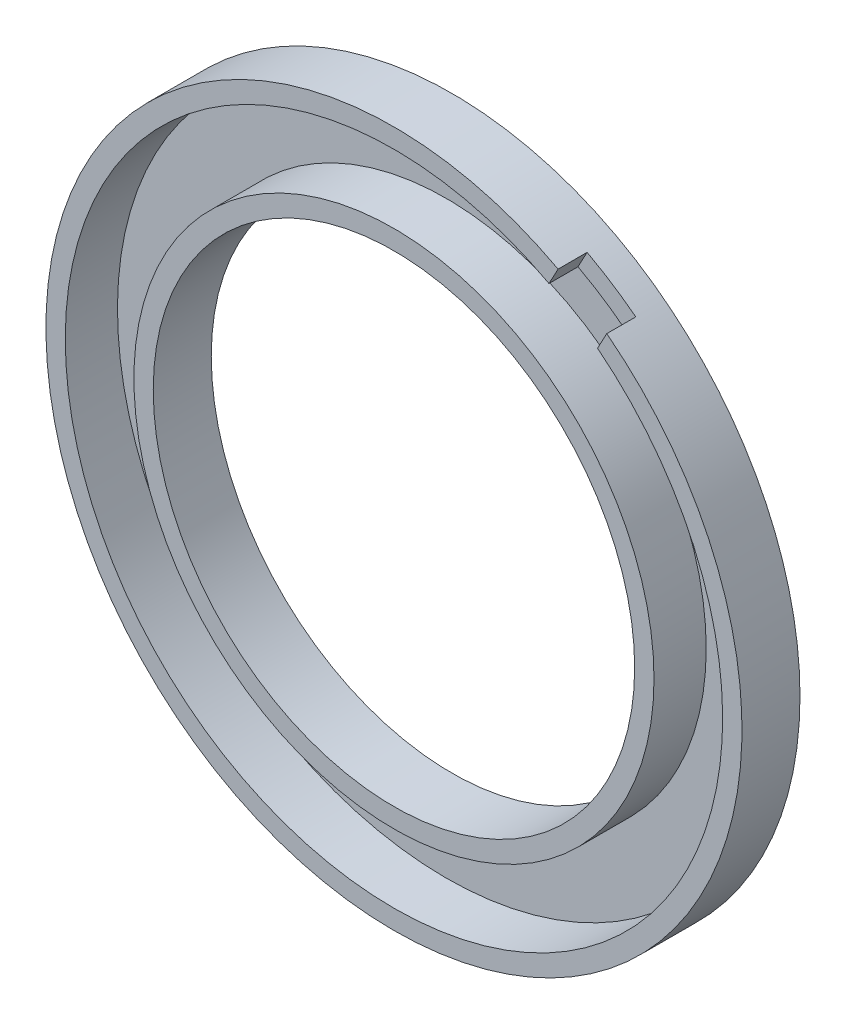
ISO-10303-21;
HEADER;
FILE_DESCRIPTION(('STEP AP214'),'2;1');
FILE_NAME('part.step','',(''),(''),'','','');
FILE_SCHEMA(('AUTOMOTIVE_DESIGN { 1 0 10303 214 1 1 1 1 }'));
ENDSEC;
DATA;
#1=APPLICATION_CONTEXT('core data for automotive mechanical design processes');
#2=APPLICATION_PROTOCOL_DEFINITION('international standard','automotive_design',2000,#1);
#3=PRODUCT_CONTEXT('',#1,'mechanical');
#4=PRODUCT('Part','Part','',(#3));
#5=PRODUCT_RELATED_PRODUCT_CATEGORY('part','',(#4));
#6=PRODUCT_DEFINITION_FORMATION('','',#4);
#7=PRODUCT_DEFINITION_CONTEXT('part definition',#1,'design');
#8=PRODUCT_DEFINITION('design','',#6,#7);
#9=PRODUCT_DEFINITION_SHAPE('','',#8);
#10=(LENGTH_UNIT() NAMED_UNIT(*) SI_UNIT(.MILLI.,.METRE.));
#11=(NAMED_UNIT(*) PLANE_ANGLE_UNIT() SI_UNIT($,.RADIAN.));
#12=(NAMED_UNIT(*) SI_UNIT($,.STERADIAN.) SOLID_ANGLE_UNIT());
#13=UNCERTAINTY_MEASURE_WITH_UNIT(LENGTH_MEASURE(1.E-05),#10,'distance_accuracy_value','');
#14=(GEOMETRIC_REPRESENTATION_CONTEXT(3) GLOBAL_UNCERTAINTY_ASSIGNED_CONTEXT((#13)) GLOBAL_UNIT_ASSIGNED_CONTEXT((#10,
#11,#12)) REPRESENTATION_CONTEXT('',''));
#15=CARTESIAN_POINT('',(0.,0.,0.));
#16=DIRECTION('',(0.,0.,1.));
#17=DIRECTION('',(1.,0.,0.));
#18=AXIS2_PLACEMENT_3D('',#15,#16,#17);
#19=CARTESIAN_POINT('',(0.,0.,6.));
#20=DIRECTION('',(0.,0.,-1.));
#21=DIRECTION('',(-1.,0.,0.));
#22=AXIS2_PLACEMENT_3D('',#19,#20,#21);
#23=CYLINDRICAL_SURFACE('',#22,34.);
#24=DIRECTION('',(0.,0.,1.));
#25=VECTOR('',#24,1.);
#26=CARTESIAN_POINT('',(21.0557681829435,26.695591887541,3.));
#27=LINE('',#26,#25);
#28=CARTESIAN_POINT('',(21.0557681829435,26.695591887541,3.));
#29=VERTEX_POINT('',#28);
#30=CARTESIAN_POINT('',(21.0557681829435,26.695591887541,6.));
#31=VERTEX_POINT('',#30);
#32=EDGE_CURVE('E92',#29,#31,#27,.T.);
#33=ORIENTED_EDGE('',*,*,#32,.F.);
#34=CARTESIAN_POINT('',(0.,0.,3.));
#35=DIRECTION('',(0.,0.,1.));
#36=DIRECTION('',(1.,0.,0.));
#37=AXIS2_PLACEMENT_3D('',#34,#35,#36);
#38=CIRCLE('',#37,34.);
#39=CARTESIAN_POINT('',(16.0352978469225,29.9811477925793,3.));
#40=VERTEX_POINT('',#39);
#41=EDGE_CURVE('E95',#29,#40,#38,.T.);
#42=ORIENTED_EDGE('',*,*,#41,.T.);
#43=DIRECTION('',(0.,0.,1.));
#44=VECTOR('',#43,1.);
#45=CARTESIAN_POINT('',(16.0352978469225,29.9811477925793,3.));
#46=LINE('',#45,#44);
#47=CARTESIAN_POINT('',(16.0352978469225,29.9811477925793,6.));
#48=VERTEX_POINT('',#47);
#49=EDGE_CURVE('E84',#40,#48,#46,.T.);
#50=ORIENTED_EDGE('',*,*,#49,.T.);
#51=CARTESIAN_POINT('',(0.,0.,6.));
#52=DIRECTION('',(0.,0.,1.));
#53=DIRECTION('',(1.,0.,0.));
#54=AXIS2_PLACEMENT_3D('',#51,#52,#53);
#55=CIRCLE('',#54,34.);
#56=EDGE_CURVE('E117',#48,#31,#55,.T.);
#57=ORIENTED_EDGE('',*,*,#56,.T.);
#58=EDGE_LOOP('',(#33,#42,#50,#57));
#59=FACE_BOUND('',#58,.T.);
#60=CARTESIAN_POINT('',(0.,0.,0.6));
#61=DIRECTION('',(0.,0.,1.));
#62=DIRECTION('',(1.,0.,0.));
#63=AXIS2_PLACEMENT_3D('',#60,#61,#62);
#64=CIRCLE('',#63,34.);
#65=CARTESIAN_POINT('',(34.,0.,0.6));
#66=VERTEX_POINT('',#65);
#67=EDGE_CURVE('E47',#66,#66,#64,.T.);
#68=ORIENTED_EDGE('',*,*,#67,.F.);
#69=EDGE_LOOP('',(#68));
#70=FACE_BOUND('',#69,.T.);
#71=ADVANCED_FACE('F40',(#59,#70),#23,.F.);
#72=CARTESIAN_POINT('',(0.,0.,6.));
#73=DIRECTION('',(0.,0.,-1.));
#74=DIRECTION('',(-1.,0.,0.));
#75=AXIS2_PLACEMENT_3D('',#72,#73,#74);
#76=CYLINDRICAL_SURFACE('',#75,36.);
#77=CARTESIAN_POINT('',(0.,0.,3.));
#78=DIRECTION('',(0.,0.,1.));
#79=DIRECTION('',(1.,0.,0.));
#80=AXIS2_PLACEMENT_3D('',#77,#78,#79);
#81=CIRCLE('',#80,36.);
#82=CARTESIAN_POINT('',(22.0151254384209,28.4839297136227,3.));
#83=VERTEX_POINT('',#82);
#84=CARTESIAN_POINT('',(16.9785506614473,31.7447447215546,3.));
#85=VERTEX_POINT('',#84);
#86=EDGE_CURVE('E12',#83,#85,#81,.T.);
#87=ORIENTED_EDGE('',*,*,#86,.F.);
#88=DIRECTION('',(0.,0.,1.));
#89=VECTOR('',#88,1.);
#90=CARTESIAN_POINT('',(22.0151254384209,28.4839297136227,3.));
#91=LINE('',#90,#89);
#92=CARTESIAN_POINT('',(22.0151254384209,28.4839297136227,6.));
#93=VERTEX_POINT('',#92);
#94=EDGE_CURVE('E63',#83,#93,#91,.T.);
#95=ORIENTED_EDGE('',*,*,#94,.T.);
#96=CARTESIAN_POINT('',(0.,0.,6.));
#97=DIRECTION('',(0.,0.,1.));
#98=DIRECTION('',(1.,0.,0.));
#99=AXIS2_PLACEMENT_3D('',#96,#97,#98);
#100=CIRCLE('',#99,36.);
#101=CARTESIAN_POINT('',(16.9785506614473,31.7447447215546,6.));
#102=VERTEX_POINT('',#101);
#103=EDGE_CURVE('E119',#102,#93,#100,.T.);
#104=ORIENTED_EDGE('',*,*,#103,.F.);
#105=DIRECTION('',(0.,0.,1.));
#106=VECTOR('',#105,1.);
#107=CARTESIAN_POINT('',(16.9785506614473,31.7447447215546,3.));
#108=LINE('',#107,#106);
#109=EDGE_CURVE('E54',#85,#102,#108,.T.);
#110=ORIENTED_EDGE('',*,*,#109,.F.);
#111=EDGE_LOOP('',(#87,#95,#104,#110));
#112=FACE_BOUND('',#111,.T.);
#113=CARTESIAN_POINT('',(0.,0.,0.));
#114=DIRECTION('',(0.,0.,1.));
#115=DIRECTION('',(1.,0.,0.));
#116=AXIS2_PLACEMENT_3D('',#113,#114,#115);
#117=CIRCLE('',#116,36.);
#118=CARTESIAN_POINT('',(36.,0.,0.));
#119=VERTEX_POINT('',#118);
#120=EDGE_CURVE('E116',#119,#119,#117,.T.);
#121=ORIENTED_EDGE('',*,*,#120,.T.);
#122=EDGE_LOOP('',(#121));
#123=FACE_BOUND('',#122,.T.);
#124=ADVANCED_FACE('F128',(#112,#123),#76,.T.);
#125=CARTESIAN_POINT('',(0.,0.,6.));
#126=DIRECTION('',(0.,0.,1.));
#127=DIRECTION('',(1.,0.,0.));
#128=AXIS2_PLACEMENT_3D('',#125,#126,#127);
#129=PLANE('',#128);
#130=DIRECTION('',(0.472726395517798,0.881209257203277,0.));
#131=VECTOR('',#130,1.);
#132=CARTESIAN_POINT('',(22.0151254384209,28.4839297136227,6.));
#133=LINE('',#132,#131);
#134=EDGE_CURVE('E77',#31,#93,#133,.T.);
#135=ORIENTED_EDGE('',*,*,#134,.F.);
#136=ORIENTED_EDGE('',*,*,#56,.F.);
#137=DIRECTION('',(-0.471626407262426,-0.881798464487627,0.));
#138=VECTOR('',#137,1.);
#139=CARTESIAN_POINT('',(16.0352978469225,29.9811477925793,6.));
#140=LINE('',#139,#138);
#141=EDGE_CURVE('E87',#102,#48,#140,.T.);
#142=ORIENTED_EDGE('',*,*,#141,.F.);
#143=ORIENTED_EDGE('',*,*,#103,.T.);
#144=EDGE_LOOP('',(#135,#136,#142,#143));
#145=FACE_BOUND('',#144,.T.);
#146=ADVANCED_FACE('F132',(#145),#129,.T.);
#147=CARTESIAN_POINT('',(0.,0.,0.));
#148=DIRECTION('',(0.,0.,1.));
#149=DIRECTION('',(1.,0.,0.));
#150=AXIS2_PLACEMENT_3D('',#147,#148,#149);
#151=PLANE('',#150);
#152=ORIENTED_EDGE('',*,*,#120,.F.);
#153=EDGE_LOOP('',(#152));
#154=FACE_BOUND('',#153,.T.);
#155=CARTESIAN_POINT('',(0.,0.,0.));
#156=DIRECTION('',(0.,0.,1.));
#157=DIRECTION('',(1.,0.,0.));
#158=AXIS2_PLACEMENT_3D('',#155,#156,#157);
#159=CIRCLE('',#158,24.9);
#160=CARTESIAN_POINT('',(24.9,0.,0.));
#161=VERTEX_POINT('',#160);
#162=EDGE_CURVE('E100',#161,#161,#159,.T.);
#163=ORIENTED_EDGE('',*,*,#162,.T.);
#164=EDGE_LOOP('',(#163));
#165=FACE_BOUND('',#164,.T.);
#166=ADVANCED_FACE('F137',(#154,#165),#151,.F.);
#167=CARTESIAN_POINT('',(0.,0.,0.6));
#168=DIRECTION('',(0.,0.,1.));
#169=DIRECTION('',(1.,0.,0.));
#170=AXIS2_PLACEMENT_3D('',#167,#168,#169);
#171=PLANE('',#170);
#172=CARTESIAN_POINT('',(0.,0.,0.6));
#173=DIRECTION('',(0.,0.,1.));
#174=DIRECTION('',(1.,0.,0.));
#175=AXIS2_PLACEMENT_3D('',#172,#173,#174);
#176=CIRCLE('',#175,26.9);
#177=CARTESIAN_POINT('',(26.9,0.,0.6));
#178=VERTEX_POINT('',#177);
#179=EDGE_CURVE('E112',#178,#178,#176,.T.);
#180=ORIENTED_EDGE('',*,*,#179,.F.);
#181=EDGE_LOOP('',(#180));
#182=FACE_BOUND('',#181,.T.);
#183=ORIENTED_EDGE('',*,*,#67,.T.);
#184=EDGE_LOOP('',(#183));
#185=FACE_BOUND('',#184,.T.);
#186=ADVANCED_FACE('F126',(#182,#185),#171,.T.);
#187=CARTESIAN_POINT('',(0.,0.,6.));
#188=DIRECTION('',(0.,0.,-1.));
#189=DIRECTION('',(-1.,0.,0.));
#190=AXIS2_PLACEMENT_3D('',#187,#188,#189);
#191=CYLINDRICAL_SURFACE('',#190,24.9);
#192=CARTESIAN_POINT('',(0.,0.,6.));
#193=DIRECTION('',(0.,0.,1.));
#194=DIRECTION('',(1.,0.,0.));
#195=AXIS2_PLACEMENT_3D('',#192,#193,#194);
#196=CIRCLE('',#195,24.9);
#197=CARTESIAN_POINT('',(24.9,0.,6.));
#198=VERTEX_POINT('',#197);
#199=EDGE_CURVE('E103',#198,#198,#196,.T.);
#200=ORIENTED_EDGE('',*,*,#199,.T.);
#201=EDGE_LOOP('',(#200));
#202=FACE_BOUND('',#201,.T.);
#203=ORIENTED_EDGE('',*,*,#162,.F.);
#204=EDGE_LOOP('',(#203));
#205=FACE_BOUND('',#204,.T.);
#206=ADVANCED_FACE('F147',(#202,#205),#191,.F.);
#207=CARTESIAN_POINT('',(0.,0.,6.));
#208=DIRECTION('',(0.,0.,-1.));
#209=DIRECTION('',(-1.,0.,0.));
#210=AXIS2_PLACEMENT_3D('',#207,#208,#209);
#211=CYLINDRICAL_SURFACE('',#210,26.9);
#212=ORIENTED_EDGE('',*,*,#179,.T.);
#213=EDGE_LOOP('',(#212));
#214=FACE_BOUND('',#213,.T.);
#215=CARTESIAN_POINT('',(0.,0.,6.));
#216=DIRECTION('',(0.,0.,1.));
#217=DIRECTION('',(1.,0.,0.));
#218=AXIS2_PLACEMENT_3D('',#215,#216,#217);
#219=CIRCLE('',#218,26.9);
#220=CARTESIAN_POINT('',(26.9,0.,6.));
#221=VERTEX_POINT('',#220);
#222=EDGE_CURVE('E110',#221,#221,#219,.T.);
#223=ORIENTED_EDGE('',*,*,#222,.F.);
#224=EDGE_LOOP('',(#223));
#225=FACE_BOUND('',#224,.T.);
#226=ADVANCED_FACE('F151',(#214,#225),#211,.T.);
#227=CARTESIAN_POINT('',(0.,0.,6.));
#228=DIRECTION('',(0.,0.,1.));
#229=DIRECTION('',(1.,0.,0.));
#230=AXIS2_PLACEMENT_3D('',#227,#228,#229);
#231=PLANE('',#230);
#232=ORIENTED_EDGE('',*,*,#199,.F.);
#233=EDGE_LOOP('',(#232));
#234=FACE_BOUND('',#233,.T.);
#235=ORIENTED_EDGE('',*,*,#222,.T.);
#236=EDGE_LOOP('',(#235));
#237=FACE_BOUND('',#236,.T.);
#238=ADVANCED_FACE('F155',(#234,#237),#231,.T.);
#239=CARTESIAN_POINT('',(0.,0.,3.));
#240=DIRECTION('',(0.,0.,1.));
#241=DIRECTION('',(1.,0.,0.));
#242=AXIS2_PLACEMENT_3D('',#239,#240,#241);
#243=PLANE('',#242);
#244=DIRECTION('',(0.472726395517798,0.881209257203277,0.));
#245=VECTOR('',#244,1.);
#246=CARTESIAN_POINT('',(22.0151254384209,28.4839297136227,3.));
#247=LINE('',#246,#245);
#248=EDGE_CURVE('E96',#29,#83,#247,.T.);
#249=ORIENTED_EDGE('',*,*,#248,.T.);
#250=ORIENTED_EDGE('',*,*,#86,.T.);
#251=DIRECTION('',(-0.471626407262426,-0.881798464487627,0.));
#252=VECTOR('',#251,1.);
#253=CARTESIAN_POINT('',(16.0352978469225,29.9811477925793,3.));
#254=LINE('',#253,#252);
#255=EDGE_CURVE('E86',#85,#40,#254,.T.);
#256=ORIENTED_EDGE('',*,*,#255,.T.);
#257=ORIENTED_EDGE('',*,*,#41,.F.);
#258=EDGE_LOOP('',(#249,#250,#256,#257));
#259=FACE_BOUND('',#258,.T.);
#260=ADVANCED_FACE('F94',(#259),#243,.T.);
#261=CARTESIAN_POINT('',(22.0151254384209,28.4839297136227,3.));
#262=DIRECTION('',(0.881209257203277,-0.472726395517798,0.));
#263=DIRECTION('',(0.472726395517798,0.881209257203277,0.));
#264=AXIS2_PLACEMENT_3D('',#261,#262,#263);
#265=PLANE('',#264);
#266=ORIENTED_EDGE('',*,*,#134,.T.);
#267=ORIENTED_EDGE('',*,*,#94,.F.);
#268=ORIENTED_EDGE('',*,*,#248,.F.);
#269=ORIENTED_EDGE('',*,*,#32,.T.);
#270=EDGE_LOOP('',(#266,#267,#268,#269));
#271=FACE_BOUND('',#270,.T.);
#272=ADVANCED_FACE('F162',(#271),#265,.F.);
#273=CARTESIAN_POINT('',(16.0352978469225,29.9811477925793,3.));
#274=DIRECTION('',(-0.881798464487627,0.471626407262426,0.));
#275=DIRECTION('',(-0.471626407262426,-0.881798464487627,0.));
#276=AXIS2_PLACEMENT_3D('',#273,#274,#275);
#277=PLANE('',#276);
#278=ORIENTED_EDGE('',*,*,#141,.T.);
#279=ORIENTED_EDGE('',*,*,#49,.F.);
#280=ORIENTED_EDGE('',*,*,#255,.F.);
#281=ORIENTED_EDGE('',*,*,#109,.T.);
#282=EDGE_LOOP('',(#278,#279,#280,#281));
#283=FACE_BOUND('',#282,.T.);
#284=ADVANCED_FACE('F85',(#283),#277,.F.);
#285=CLOSED_SHELL('',(#71,#124,#146,#166,#186,#206,#226,#238,#260,#272,#284));
#286=MANIFOLD_SOLID_BREP('B2',#285);
#287=ADVANCED_BREP_SHAPE_REPRESENTATION('',(#18,#286),#14);
#288=SHAPE_DEFINITION_REPRESENTATION(#9,#287);
ENDSEC;
END-ISO-10303-21;
